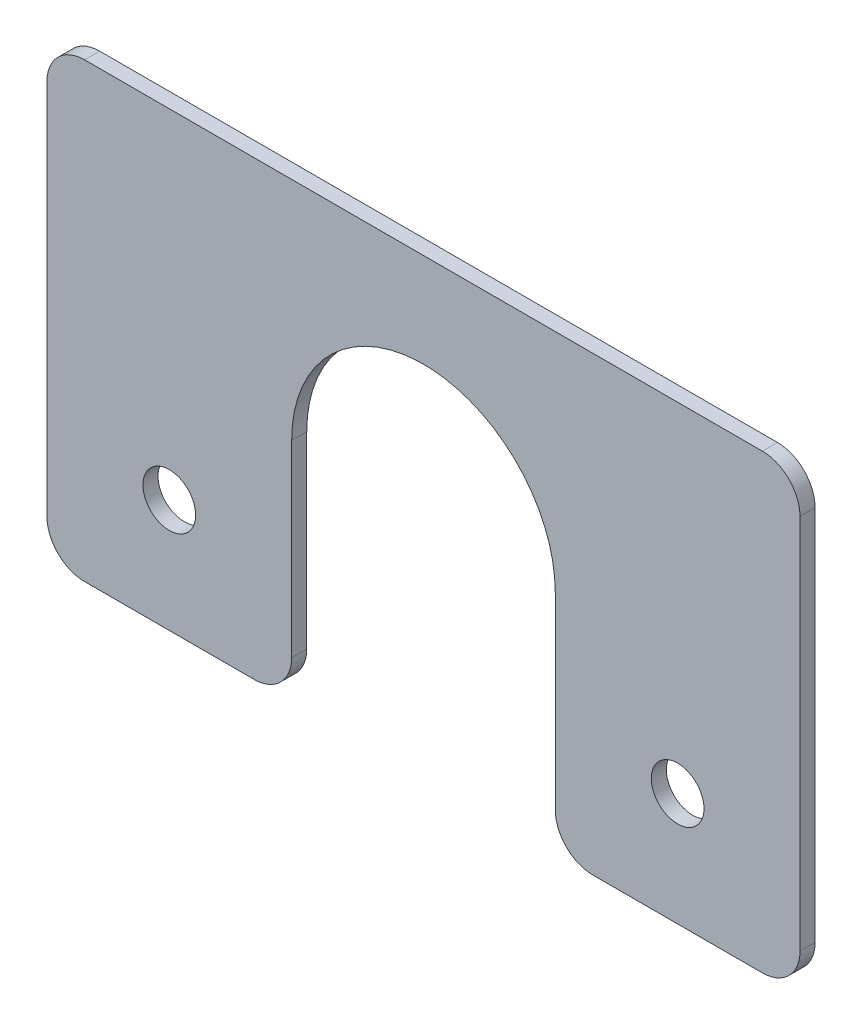
ISO-10303-21;
HEADER;
FILE_DESCRIPTION(('STEP AP214'),'2;1');
FILE_NAME('part.step','',(''),(''),'','','');
FILE_SCHEMA(('AUTOMOTIVE_DESIGN { 1 0 10303 214 1 1 1 1 }'));
ENDSEC;
DATA;
#1=APPLICATION_CONTEXT('core data for automotive mechanical design processes');
#2=APPLICATION_PROTOCOL_DEFINITION('international standard','automotive_design',2000,#1);
#3=PRODUCT_CONTEXT('',#1,'mechanical');
#4=PRODUCT('Part','Part','',(#3));
#5=PRODUCT_RELATED_PRODUCT_CATEGORY('part','',(#4));
#6=PRODUCT_DEFINITION_FORMATION('','',#4);
#7=PRODUCT_DEFINITION_CONTEXT('part definition',#1,'design');
#8=PRODUCT_DEFINITION('design','',#6,#7);
#9=PRODUCT_DEFINITION_SHAPE('','',#8);
#10=(LENGTH_UNIT() NAMED_UNIT(*) SI_UNIT(.MILLI.,.METRE.));
#11=(NAMED_UNIT(*) PLANE_ANGLE_UNIT() SI_UNIT($,.RADIAN.));
#12=(NAMED_UNIT(*) SI_UNIT($,.STERADIAN.) SOLID_ANGLE_UNIT());
#13=UNCERTAINTY_MEASURE_WITH_UNIT(LENGTH_MEASURE(1.E-05),#10,'distance_accuracy_value','');
#14=(GEOMETRIC_REPRESENTATION_CONTEXT(3) GLOBAL_UNCERTAINTY_ASSIGNED_CONTEXT((#13)) GLOBAL_UNIT_ASSIGNED_CONTEXT((#10,
#11,#12)) REPRESENTATION_CONTEXT('',''));
#15=CARTESIAN_POINT('',(0.,0.,0.));
#16=DIRECTION('',(0.,0.,1.));
#17=DIRECTION('',(1.,0.,0.));
#18=AXIS2_PLACEMENT_3D('',#15,#16,#17);
#19=CARTESIAN_POINT('',(-50.,-30.,-2.));
#20=DIRECTION('',(0.,-1.,0.));
#21=DIRECTION('',(0.,0.,-1.));
#22=AXIS2_PLACEMENT_3D('',#19,#20,#21);
#23=PLANE('',#22);
#24=DIRECTION('',(1.,0.,0.));
#25=VECTOR('',#24,1.);
#26=CARTESIAN_POINT('',(-50.,-30.,-2.));
#27=LINE('',#26,#25);
#28=CARTESIAN_POINT('',(22.5,-30.,-2.));
#29=VERTEX_POINT('',#28);
#30=CARTESIAN_POINT('',(45.,-30.,-2.));
#31=VERTEX_POINT('',#30);
#32=EDGE_CURVE('E186',#29,#31,#27,.T.);
#33=ORIENTED_EDGE('',*,*,#32,.T.);
#34=DIRECTION('',(0.,0.,1.));
#35=VECTOR('',#34,1.);
#36=CARTESIAN_POINT('',(45.,-30.,-2.));
#37=LINE('',#36,#35);
#38=CARTESIAN_POINT('',(45.,-30.,0.));
#39=VERTEX_POINT('',#38);
#40=EDGE_CURVE('E202',#31,#39,#37,.T.);
#41=ORIENTED_EDGE('',*,*,#40,.T.);
#42=DIRECTION('',(1.,0.,0.));
#43=VECTOR('',#42,1.);
#44=CARTESIAN_POINT('',(-50.,-30.,0.));
#45=LINE('',#44,#43);
#46=CARTESIAN_POINT('',(22.5,-30.,0.));
#47=VERTEX_POINT('',#46);
#48=EDGE_CURVE('E199',#47,#39,#45,.T.);
#49=ORIENTED_EDGE('',*,*,#48,.F.);
#50=DIRECTION('',(0.,0.,1.));
#51=VECTOR('',#50,1.);
#52=CARTESIAN_POINT('',(22.5,-30.,-2.));
#53=LINE('',#52,#51);
#54=EDGE_CURVE('E190',#47,#29,#53,.F.);
#55=ORIENTED_EDGE('',*,*,#54,.T.);
#56=EDGE_LOOP('',(#33,#41,#49,#55));
#57=FACE_BOUND('',#56,.T.);
#58=ADVANCED_FACE('F39',(#57),#23,.T.);
#59=CARTESIAN_POINT('',(50.,-30.,-2.));
#60=DIRECTION('',(1.,0.,0.));
#61=DIRECTION('',(0.,0.,-1.));
#62=AXIS2_PLACEMENT_3D('',#59,#60,#61);
#63=PLANE('',#62);
#64=DIRECTION('',(0.,1.,0.));
#65=VECTOR('',#64,1.);
#66=CARTESIAN_POINT('',(50.,-30.,0.));
#67=LINE('',#66,#65);
#68=CARTESIAN_POINT('',(50.,-25.,0.));
#69=VERTEX_POINT('',#68);
#70=CARTESIAN_POINT('',(50.,25.,0.));
#71=VERTEX_POINT('',#70);
#72=EDGE_CURVE('E175',#69,#71,#67,.T.);
#73=ORIENTED_EDGE('',*,*,#72,.F.);
#74=DIRECTION('',(0.,0.,1.));
#75=VECTOR('',#74,1.);
#76=CARTESIAN_POINT('',(50.,-25.,-2.));
#77=LINE('',#76,#75);
#78=CARTESIAN_POINT('',(50.,-25.,-2.));
#79=VERTEX_POINT('',#78);
#80=EDGE_CURVE('E218',#69,#79,#77,.F.);
#81=ORIENTED_EDGE('',*,*,#80,.T.);
#82=DIRECTION('',(0.,1.,0.));
#83=VECTOR('',#82,1.);
#84=CARTESIAN_POINT('',(50.,-30.,-2.));
#85=LINE('',#84,#83);
#86=CARTESIAN_POINT('',(50.,25.,-2.));
#87=VERTEX_POINT('',#86);
#88=EDGE_CURVE('E176',#79,#87,#85,.T.);
#89=ORIENTED_EDGE('',*,*,#88,.T.);
#90=DIRECTION('',(0.,0.,1.));
#91=VECTOR('',#90,1.);
#92=CARTESIAN_POINT('',(50.,25.,-2.));
#93=LINE('',#92,#91);
#94=EDGE_CURVE('E215',#87,#71,#93,.T.);
#95=ORIENTED_EDGE('',*,*,#94,.T.);
#96=EDGE_LOOP('',(#73,#81,#89,#95));
#97=FACE_BOUND('',#96,.T.);
#98=ADVANCED_FACE('F280',(#97),#63,.T.);
#99=CARTESIAN_POINT('',(-45.,-30.,-2.));
#100=VERTEX_POINT('',#99);
#101=CARTESIAN_POINT('',(-22.5,-30.,-2.));
#102=VERTEX_POINT('',#101);
#103=EDGE_CURVE('E187',#100,#102,#27,.T.);
#104=ORIENTED_EDGE('',*,*,#103,.T.);
#105=DIRECTION('',(0.,0.,1.));
#106=VECTOR('',#105,1.);
#107=CARTESIAN_POINT('',(-22.5,-30.,0.));
#108=LINE('',#107,#106);
#109=CARTESIAN_POINT('',(-22.5,-30.,0.));
#110=VERTEX_POINT('',#109);
#111=EDGE_CURVE('E243',#102,#110,#108,.T.);
#112=ORIENTED_EDGE('',*,*,#111,.T.);
#113=CARTESIAN_POINT('',(-45.,-30.,0.));
#114=VERTEX_POINT('',#113);
#115=EDGE_CURVE('E180',#114,#110,#45,.T.);
#116=ORIENTED_EDGE('',*,*,#115,.F.);
#117=DIRECTION('',(0.,0.,1.));
#118=VECTOR('',#117,1.);
#119=CARTESIAN_POINT('',(-45.,-30.,-2.));
#120=LINE('',#119,#118);
#121=EDGE_CURVE('E241',#114,#100,#120,.F.);
#122=ORIENTED_EDGE('',*,*,#121,.T.);
#123=EDGE_LOOP('',(#104,#112,#116,#122));
#124=FACE_BOUND('',#123,.T.);
#125=ADVANCED_FACE('F249',(#124),#23,.T.);
#126=CARTESIAN_POINT('',(-50.,-30.,-2.));
#127=DIRECTION('',(-1.,0.,0.));
#128=DIRECTION('',(0.,0.,1.));
#129=AXIS2_PLACEMENT_3D('',#126,#127,#128);
#130=PLANE('',#129);
#131=DIRECTION('',(0.,-1.,0.));
#132=VECTOR('',#131,1.);
#133=CARTESIAN_POINT('',(-50.,-30.,-2.));
#134=LINE('',#133,#132);
#135=CARTESIAN_POINT('',(-50.,25.,-2.));
#136=VERTEX_POINT('',#135);
#137=CARTESIAN_POINT('',(-50.,-25.,-2.));
#138=VERTEX_POINT('',#137);
#139=EDGE_CURVE('E183',#136,#138,#134,.T.);
#140=ORIENTED_EDGE('',*,*,#139,.T.);
#141=DIRECTION('',(0.,0.,1.));
#142=VECTOR('',#141,1.);
#143=CARTESIAN_POINT('',(-50.,-25.,-2.));
#144=LINE('',#143,#142);
#145=CARTESIAN_POINT('',(-50.,-25.,0.));
#146=VERTEX_POINT('',#145);
#147=EDGE_CURVE('E238',#138,#146,#144,.T.);
#148=ORIENTED_EDGE('',*,*,#147,.T.);
#149=DIRECTION('',(0.,-1.,0.));
#150=VECTOR('',#149,1.);
#151=CARTESIAN_POINT('',(-50.,-30.,0.));
#152=LINE('',#151,#150);
#153=CARTESIAN_POINT('',(-50.,25.,0.));
#154=VERTEX_POINT('',#153);
#155=EDGE_CURVE('E196',#154,#146,#152,.T.);
#156=ORIENTED_EDGE('',*,*,#155,.F.);
#157=DIRECTION('',(0.,0.,1.));
#158=VECTOR('',#157,1.);
#159=CARTESIAN_POINT('',(-50.,25.,-2.));
#160=LINE('',#159,#158);
#161=EDGE_CURVE('E236',#154,#136,#160,.F.);
#162=ORIENTED_EDGE('',*,*,#161,.T.);
#163=EDGE_LOOP('',(#140,#148,#156,#162));
#164=FACE_BOUND('',#163,.T.);
#165=ADVANCED_FACE('F260',(#164),#130,.T.);
#166=CARTESIAN_POINT('',(-50.,30.,-2.));
#167=DIRECTION('',(0.,1.,0.));
#168=DIRECTION('',(0.,0.,1.));
#169=AXIS2_PLACEMENT_3D('',#166,#167,#168);
#170=PLANE('',#169);
#171=DIRECTION('',(-1.,0.,0.));
#172=VECTOR('',#171,1.);
#173=CARTESIAN_POINT('',(-50.,30.,0.));
#174=LINE('',#173,#172);
#175=CARTESIAN_POINT('',(45.,30.,0.));
#176=VERTEX_POINT('',#175);
#177=CARTESIAN_POINT('',(-45.,30.,0.));
#178=VERTEX_POINT('',#177);
#179=EDGE_CURVE('E193',#176,#178,#174,.T.);
#180=ORIENTED_EDGE('',*,*,#179,.F.);
#181=DIRECTION('',(0.,0.,1.));
#182=VECTOR('',#181,1.);
#183=CARTESIAN_POINT('',(45.,30.,-2.));
#184=LINE('',#183,#182);
#185=CARTESIAN_POINT('',(45.,30.,-2.));
#186=VERTEX_POINT('',#185);
#187=EDGE_CURVE('E233',#176,#186,#184,.F.);
#188=ORIENTED_EDGE('',*,*,#187,.T.);
#189=DIRECTION('',(-1.,0.,0.));
#190=VECTOR('',#189,1.);
#191=CARTESIAN_POINT('',(-50.,30.,-2.));
#192=LINE('',#191,#190);
#193=CARTESIAN_POINT('',(-45.,30.,-2.));
#194=VERTEX_POINT('',#193);
#195=EDGE_CURVE('E179',#186,#194,#192,.T.);
#196=ORIENTED_EDGE('',*,*,#195,.T.);
#197=DIRECTION('',(0.,0.,1.));
#198=VECTOR('',#197,1.);
#199=CARTESIAN_POINT('',(-45.,30.,-2.));
#200=LINE('',#199,#198);
#201=EDGE_CURVE('E230',#194,#178,#200,.T.);
#202=ORIENTED_EDGE('',*,*,#201,.T.);
#203=EDGE_LOOP('',(#180,#188,#196,#202));
#204=FACE_BOUND('',#203,.T.);
#205=ADVANCED_FACE('F272',(#204),#170,.T.);
#206=CARTESIAN_POINT('',(0.,0.,-2.));
#207=DIRECTION('',(0.,0.,-1.));
#208=DIRECTION('',(-1.,0.,0.));
#209=AXIS2_PLACEMENT_3D('',#206,#207,#208);
#210=PLANE('',#209);
#211=CARTESIAN_POINT('',(-33.75,-15.,-2.));
#212=DIRECTION('',(0.,0.,-1.));
#213=DIRECTION('',(-1.,0.,0.));
#214=AXIS2_PLACEMENT_3D('',#211,#212,#213);
#215=CIRCLE('',#214,3.5);
#216=CARTESIAN_POINT('',(-37.25,-15.,-2.));
#217=VERTEX_POINT('',#216);
#218=EDGE_CURVE('E162',#217,#217,#215,.T.);
#219=ORIENTED_EDGE('',*,*,#218,.F.);
#220=EDGE_LOOP('',(#219));
#221=FACE_BOUND('',#220,.T.);
#222=CARTESIAN_POINT('',(33.75,-15.,-2.));
#223=DIRECTION('',(0.,0.,-1.));
#224=DIRECTION('',(-1.,0.,0.));
#225=AXIS2_PLACEMENT_3D('',#222,#223,#224);
#226=CIRCLE('',#225,3.5);
#227=CARTESIAN_POINT('',(30.25,-15.,-2.));
#228=VERTEX_POINT('',#227);
#229=EDGE_CURVE('E166',#228,#228,#226,.T.);
#230=ORIENTED_EDGE('',*,*,#229,.F.);
#231=EDGE_LOOP('',(#230));
#232=FACE_BOUND('',#231,.T.);
#233=DIRECTION('',(0.,1.,0.));
#234=VECTOR('',#233,1.);
#235=CARTESIAN_POINT('',(-17.5,0.,-2.));
#236=LINE('',#235,#234);
#237=CARTESIAN_POINT('',(-17.5,-25.,-2.));
#238=VERTEX_POINT('',#237);
#239=CARTESIAN_POINT('',(-17.5,0.,-2.));
#240=VERTEX_POINT('',#239);
#241=EDGE_CURVE('E159',#238,#240,#236,.T.);
#242=ORIENTED_EDGE('',*,*,#241,.F.);
#243=CARTESIAN_POINT('',(-22.5,-25.,-2.));
#244=DIRECTION('',(0.,0.,-1.));
#245=DIRECTION('',(-1.,0.,0.));
#246=AXIS2_PLACEMENT_3D('',#243,#244,#245);
#247=CIRCLE('',#246,5.);
#248=EDGE_CURVE('E11',#238,#102,#247,.T.);
#249=ORIENTED_EDGE('',*,*,#248,.T.);
#250=ORIENTED_EDGE('',*,*,#103,.F.);
#251=CARTESIAN_POINT('',(-45.,-25.,-2.));
#252=DIRECTION('',(0.,0.,-1.));
#253=DIRECTION('',(-1.,0.,0.));
#254=AXIS2_PLACEMENT_3D('',#251,#252,#253);
#255=CIRCLE('',#254,5.);
#256=EDGE_CURVE('E222',#100,#138,#255,.T.);
#257=ORIENTED_EDGE('',*,*,#256,.T.);
#258=ORIENTED_EDGE('',*,*,#139,.F.);
#259=CARTESIAN_POINT('',(-45.,25.,-2.));
#260=DIRECTION('',(0.,0.,-1.));
#261=DIRECTION('',(-1.,0.,0.));
#262=AXIS2_PLACEMENT_3D('',#259,#260,#261);
#263=CIRCLE('',#262,5.);
#264=EDGE_CURVE('E220',#136,#194,#263,.T.);
#265=ORIENTED_EDGE('',*,*,#264,.T.);
#266=ORIENTED_EDGE('',*,*,#195,.F.);
#267=CARTESIAN_POINT('',(45.,25.,-2.));
#268=DIRECTION('',(0.,0.,-1.));
#269=DIRECTION('',(-1.,0.,0.));
#270=AXIS2_PLACEMENT_3D('',#267,#268,#269);
#271=CIRCLE('',#270,5.);
#272=EDGE_CURVE('E226',#186,#87,#271,.T.);
#273=ORIENTED_EDGE('',*,*,#272,.T.);
#274=ORIENTED_EDGE('',*,*,#88,.F.);
#275=CARTESIAN_POINT('',(45.,-25.,-2.));
#276=DIRECTION('',(0.,0.,-1.));
#277=DIRECTION('',(-1.,0.,0.));
#278=AXIS2_PLACEMENT_3D('',#275,#276,#277);
#279=CIRCLE('',#278,5.);
#280=EDGE_CURVE('E228',#79,#31,#279,.T.);
#281=ORIENTED_EDGE('',*,*,#280,.T.);
#282=ORIENTED_EDGE('',*,*,#32,.F.);
#283=CARTESIAN_POINT('',(22.5,-25.,-2.));
#284=DIRECTION('',(0.,0.,-1.));
#285=DIRECTION('',(-1.,0.,0.));
#286=AXIS2_PLACEMENT_3D('',#283,#284,#285);
#287=CIRCLE('',#286,5.);
#288=CARTESIAN_POINT('',(17.5,-25.,-2.));
#289=VERTEX_POINT('',#288);
#290=EDGE_CURVE('E224',#29,#289,#287,.T.);
#291=ORIENTED_EDGE('',*,*,#290,.T.);
#292=DIRECTION('',(0.,-1.,0.));
#293=VECTOR('',#292,1.);
#294=CARTESIAN_POINT('',(17.5,0.,-2.));
#295=LINE('',#294,#293);
#296=CARTESIAN_POINT('',(17.5,0.,-2.));
#297=VERTEX_POINT('',#296);
#298=EDGE_CURVE('E172',#297,#289,#295,.T.);
#299=ORIENTED_EDGE('',*,*,#298,.F.);
#300=CARTESIAN_POINT('',(0.,0.,-2.));
#301=DIRECTION('',(0.,0.,-1.));
#302=DIRECTION('',(-1.,0.,0.));
#303=AXIS2_PLACEMENT_3D('',#300,#301,#302);
#304=CIRCLE('',#303,17.5);
#305=EDGE_CURVE('E158',#240,#297,#304,.T.);
#306=ORIENTED_EDGE('',*,*,#305,.F.);
#307=EDGE_LOOP('',(#242,#249,#250,#257,#258,#265,#266,#273,#274,#281,#282,#291,#299,#306));
#308=FACE_BOUND('',#307,.T.);
#309=ADVANCED_FACE('F265',(#221,#232,#308),#210,.T.);
#310=CARTESIAN_POINT('',(0.,0.,0.));
#311=DIRECTION('',(0.,0.,-1.));
#312=DIRECTION('',(-1.,0.,0.));
#313=AXIS2_PLACEMENT_3D('',#310,#311,#312);
#314=PLANE('',#313);
#315=CARTESIAN_POINT('',(-33.75,-15.,0.));
#316=DIRECTION('',(0.,0.,1.));
#317=DIRECTION('',(1.,0.,0.));
#318=AXIS2_PLACEMENT_3D('',#315,#316,#317);
#319=CIRCLE('',#318,3.5);
#320=CARTESIAN_POINT('',(-30.25,-15.,0.));
#321=VERTEX_POINT('',#320);
#322=EDGE_CURVE('E355',#321,#321,#319,.T.);
#323=ORIENTED_EDGE('',*,*,#322,.F.);
#324=EDGE_LOOP('',(#323));
#325=FACE_BOUND('',#324,.T.);
#326=CARTESIAN_POINT('',(33.75,-15.,0.));
#327=DIRECTION('',(0.,0.,1.));
#328=DIRECTION('',(1.,0.,0.));
#329=AXIS2_PLACEMENT_3D('',#326,#327,#328);
#330=CIRCLE('',#329,3.5);
#331=CARTESIAN_POINT('',(37.25,-15.,0.));
#332=VERTEX_POINT('',#331);
#333=EDGE_CURVE('E358',#332,#332,#330,.T.);
#334=ORIENTED_EDGE('',*,*,#333,.F.);
#335=EDGE_LOOP('',(#334));
#336=FACE_BOUND('',#335,.T.);
#337=ORIENTED_EDGE('',*,*,#115,.T.);
#338=CARTESIAN_POINT('',(-22.5,-25.,0.));
#339=DIRECTION('',(0.,0.,-1.));
#340=DIRECTION('',(-1.,0.,0.));
#341=AXIS2_PLACEMENT_3D('',#338,#339,#340);
#342=CIRCLE('',#341,5.);
#343=CARTESIAN_POINT('',(-17.5,-25.,0.));
#344=VERTEX_POINT('',#343);
#345=EDGE_CURVE('E61',#110,#344,#342,.F.);
#346=ORIENTED_EDGE('',*,*,#345,.T.);
#347=DIRECTION('',(0.,-1.,0.));
#348=VECTOR('',#347,1.);
#349=CARTESIAN_POINT('',(-17.5,0.,0.));
#350=LINE('',#349,#348);
#351=CARTESIAN_POINT('',(-17.5,0.,0.));
#352=VERTEX_POINT('',#351);
#353=EDGE_CURVE('E150',#352,#344,#350,.T.);
#354=ORIENTED_EDGE('',*,*,#353,.F.);
#355=CARTESIAN_POINT('',(0.,0.,0.));
#356=DIRECTION('',(0.,0.,1.));
#357=DIRECTION('',(1.,0.,0.));
#358=AXIS2_PLACEMENT_3D('',#355,#356,#357);
#359=CIRCLE('',#358,17.5);
#360=CARTESIAN_POINT('',(17.5,0.,0.));
#361=VERTEX_POINT('',#360);
#362=EDGE_CURVE('E155',#361,#352,#359,.T.);
#363=ORIENTED_EDGE('',*,*,#362,.F.);
#364=DIRECTION('',(0.,1.,0.));
#365=VECTOR('',#364,1.);
#366=CARTESIAN_POINT('',(17.5,-30.,0.));
#367=LINE('',#366,#365);
#368=CARTESIAN_POINT('',(17.5,-25.,0.));
#369=VERTEX_POINT('',#368);
#370=EDGE_CURVE('E140',#369,#361,#367,.T.);
#371=ORIENTED_EDGE('',*,*,#370,.F.);
#372=CARTESIAN_POINT('',(22.5,-25.,0.));
#373=DIRECTION('',(0.,0.,-1.));
#374=DIRECTION('',(-1.,0.,0.));
#375=AXIS2_PLACEMENT_3D('',#372,#373,#374);
#376=CIRCLE('',#375,5.);
#377=EDGE_CURVE('E209',#369,#47,#376,.F.);
#378=ORIENTED_EDGE('',*,*,#377,.T.);
#379=ORIENTED_EDGE('',*,*,#48,.T.);
#380=CARTESIAN_POINT('',(45.,-25.,0.));
#381=DIRECTION('',(0.,0.,-1.));
#382=DIRECTION('',(-1.,0.,0.));
#383=AXIS2_PLACEMENT_3D('',#380,#381,#382);
#384=CIRCLE('',#383,5.);
#385=EDGE_CURVE('E213',#39,#69,#384,.F.);
#386=ORIENTED_EDGE('',*,*,#385,.T.);
#387=ORIENTED_EDGE('',*,*,#72,.T.);
#388=CARTESIAN_POINT('',(45.,25.,0.));
#389=DIRECTION('',(0.,0.,-1.));
#390=DIRECTION('',(-1.,0.,0.));
#391=AXIS2_PLACEMENT_3D('',#388,#389,#390);
#392=CIRCLE('',#391,5.);
#393=EDGE_CURVE('E211',#71,#176,#392,.F.);
#394=ORIENTED_EDGE('',*,*,#393,.T.);
#395=ORIENTED_EDGE('',*,*,#179,.T.);
#396=CARTESIAN_POINT('',(-45.,25.,0.));
#397=DIRECTION('',(0.,0.,-1.));
#398=DIRECTION('',(-1.,0.,0.));
#399=AXIS2_PLACEMENT_3D('',#396,#397,#398);
#400=CIRCLE('',#399,5.);
#401=EDGE_CURVE('E205',#178,#154,#400,.F.);
#402=ORIENTED_EDGE('',*,*,#401,.T.);
#403=ORIENTED_EDGE('',*,*,#155,.T.);
#404=CARTESIAN_POINT('',(-45.,-25.,0.));
#405=DIRECTION('',(0.,0.,-1.));
#406=DIRECTION('',(-1.,0.,0.));
#407=AXIS2_PLACEMENT_3D('',#404,#405,#406);
#408=CIRCLE('',#407,5.);
#409=EDGE_CURVE('E207',#146,#114,#408,.F.);
#410=ORIENTED_EDGE('',*,*,#409,.T.);
#411=EDGE_LOOP('',(#337,#346,#354,#363,#371,#378,#379,#386,#387,#394,#395,#402,#403,#410));
#412=FACE_BOUND('',#411,.T.);
#413=ADVANCED_FACE('F161',(#325,#336,#412),#314,.F.);
#414=CARTESIAN_POINT('',(0.,0.,-10.));
#415=DIRECTION('',(0.,0.,1.));
#416=DIRECTION('',(1.,0.,0.));
#417=AXIS2_PLACEMENT_3D('',#414,#415,#416);
#418=CYLINDRICAL_SURFACE('',#417,17.5);
#419=ORIENTED_EDGE('',*,*,#305,.T.);
#420=DIRECTION('',(0.,0.,1.));
#421=VECTOR('',#420,1.);
#422=CARTESIAN_POINT('',(17.5,0.,-10.));
#423=LINE('',#422,#421);
#424=EDGE_CURVE('E144',#297,#361,#423,.T.);
#425=ORIENTED_EDGE('',*,*,#424,.T.);
#426=ORIENTED_EDGE('',*,*,#362,.T.);
#427=DIRECTION('',(0.,0.,1.));
#428=VECTOR('',#427,1.);
#429=CARTESIAN_POINT('',(-17.5,0.,-10.));
#430=LINE('',#429,#428);
#431=EDGE_CURVE('E149',#240,#352,#430,.T.);
#432=ORIENTED_EDGE('',*,*,#431,.F.);
#433=EDGE_LOOP('',(#419,#425,#426,#432));
#434=FACE_BOUND('',#433,.T.);
#435=ADVANCED_FACE('F153',(#434),#418,.F.);
#436=CARTESIAN_POINT('',(17.5,-30.,-10.));
#437=DIRECTION('',(1.,0.,0.));
#438=DIRECTION('',(0.,1.,0.));
#439=AXIS2_PLACEMENT_3D('',#436,#437,#438);
#440=PLANE('',#439);
#441=ORIENTED_EDGE('',*,*,#298,.T.);
#442=DIRECTION('',(0.,0.,1.));
#443=VECTOR('',#442,1.);
#444=CARTESIAN_POINT('',(17.5,-25.,0.));
#445=LINE('',#444,#443);
#446=EDGE_CURVE('E147',#289,#369,#445,.T.);
#447=ORIENTED_EDGE('',*,*,#446,.T.);
#448=ORIENTED_EDGE('',*,*,#370,.T.);
#449=ORIENTED_EDGE('',*,*,#424,.F.);
#450=EDGE_LOOP('',(#441,#447,#448,#449));
#451=FACE_BOUND('',#450,.T.);
#452=ADVANCED_FACE('F143',(#451),#440,.F.);
#453=CARTESIAN_POINT('',(-17.5,0.,-10.));
#454=DIRECTION('',(-1.,0.,0.));
#455=DIRECTION('',(0.,-1.,0.));
#456=AXIS2_PLACEMENT_3D('',#453,#454,#455);
#457=PLANE('',#456);
#458=ORIENTED_EDGE('',*,*,#353,.T.);
#459=DIRECTION('',(0.,0.,1.));
#460=VECTOR('',#459,1.);
#461=CARTESIAN_POINT('',(-17.5,-25.,-2.));
#462=LINE('',#461,#460);
#463=EDGE_CURVE('E47',#344,#238,#462,.F.);
#464=ORIENTED_EDGE('',*,*,#463,.T.);
#465=ORIENTED_EDGE('',*,*,#241,.T.);
#466=ORIENTED_EDGE('',*,*,#431,.T.);
#467=EDGE_LOOP('',(#458,#464,#465,#466));
#468=FACE_BOUND('',#467,.T.);
#469=ADVANCED_FACE('F323',(#468),#457,.F.);
#470=CARTESIAN_POINT('',(45.,-25.,-2.));
#471=DIRECTION('',(0.,0.,1.));
#472=DIRECTION('',(1.,0.,0.));
#473=AXIS2_PLACEMENT_3D('',#470,#471,#472);
#474=CYLINDRICAL_SURFACE('',#473,5.);
#475=ORIENTED_EDGE('',*,*,#280,.F.);
#476=ORIENTED_EDGE('',*,*,#80,.F.);
#477=ORIENTED_EDGE('',*,*,#385,.F.);
#478=ORIENTED_EDGE('',*,*,#40,.F.);
#479=EDGE_LOOP('',(#475,#476,#477,#478));
#480=FACE_BOUND('',#479,.T.);
#481=ADVANCED_FACE('F288',(#480),#474,.T.);
#482=CARTESIAN_POINT('',(45.,25.,-2.));
#483=DIRECTION('',(0.,0.,1.));
#484=DIRECTION('',(1.,0.,0.));
#485=AXIS2_PLACEMENT_3D('',#482,#483,#484);
#486=CYLINDRICAL_SURFACE('',#485,5.);
#487=ORIENTED_EDGE('',*,*,#272,.F.);
#488=ORIENTED_EDGE('',*,*,#187,.F.);
#489=ORIENTED_EDGE('',*,*,#393,.F.);
#490=ORIENTED_EDGE('',*,*,#94,.F.);
#491=EDGE_LOOP('',(#487,#488,#489,#490));
#492=FACE_BOUND('',#491,.T.);
#493=ADVANCED_FACE('F278',(#492),#486,.T.);
#494=CARTESIAN_POINT('',(22.5,-25.,-10.));
#495=DIRECTION('',(0.,0.,-1.));
#496=DIRECTION('',(-1.,0.,0.));
#497=AXIS2_PLACEMENT_3D('',#494,#495,#496);
#498=CYLINDRICAL_SURFACE('',#497,5.);
#499=ORIENTED_EDGE('',*,*,#290,.F.);
#500=ORIENTED_EDGE('',*,*,#54,.F.);
#501=ORIENTED_EDGE('',*,*,#377,.F.);
#502=ORIENTED_EDGE('',*,*,#446,.F.);
#503=EDGE_LOOP('',(#499,#500,#501,#502));
#504=FACE_BOUND('',#503,.T.);
#505=ADVANCED_FACE('F295',(#504),#498,.T.);
#506=CARTESIAN_POINT('',(-45.,-25.,-2.));
#507=DIRECTION('',(0.,0.,1.));
#508=DIRECTION('',(1.,0.,0.));
#509=AXIS2_PLACEMENT_3D('',#506,#507,#508);
#510=CYLINDRICAL_SURFACE('',#509,5.);
#511=ORIENTED_EDGE('',*,*,#256,.F.);
#512=ORIENTED_EDGE('',*,*,#121,.F.);
#513=ORIENTED_EDGE('',*,*,#409,.F.);
#514=ORIENTED_EDGE('',*,*,#147,.F.);
#515=EDGE_LOOP('',(#511,#512,#513,#514));
#516=FACE_BOUND('',#515,.T.);
#517=ADVANCED_FACE('F258',(#516),#510,.T.);
#518=CARTESIAN_POINT('',(-45.,25.,-2.));
#519=DIRECTION('',(0.,0.,1.));
#520=DIRECTION('',(1.,0.,0.));
#521=AXIS2_PLACEMENT_3D('',#518,#519,#520);
#522=CYLINDRICAL_SURFACE('',#521,5.);
#523=ORIENTED_EDGE('',*,*,#264,.F.);
#524=ORIENTED_EDGE('',*,*,#161,.F.);
#525=ORIENTED_EDGE('',*,*,#401,.F.);
#526=ORIENTED_EDGE('',*,*,#201,.F.);
#527=EDGE_LOOP('',(#523,#524,#525,#526));
#528=FACE_BOUND('',#527,.T.);
#529=ADVANCED_FACE('F269',(#528),#522,.T.);
#530=CARTESIAN_POINT('',(33.75,-15.,-10.));
#531=DIRECTION('',(0.,0.,1.));
#532=DIRECTION('',(1.,0.,0.));
#533=AXIS2_PLACEMENT_3D('',#530,#531,#532);
#534=CYLINDRICAL_SURFACE('',#533,3.5);
#535=ORIENTED_EDGE('',*,*,#229,.T.);
#536=EDGE_LOOP('',(#535));
#537=FACE_BOUND('',#536,.T.);
#538=ORIENTED_EDGE('',*,*,#333,.T.);
#539=EDGE_LOOP('',(#538));
#540=FACE_BOUND('',#539,.T.);
#541=ADVANCED_FACE('F301',(#537,#540),#534,.F.);
#542=CARTESIAN_POINT('',(-33.75,-15.,-10.));
#543=DIRECTION('',(0.,0.,1.));
#544=DIRECTION('',(1.,0.,0.));
#545=AXIS2_PLACEMENT_3D('',#542,#543,#544);
#546=CYLINDRICAL_SURFACE('',#545,3.5);
#547=ORIENTED_EDGE('',*,*,#218,.T.);
#548=EDGE_LOOP('',(#547));
#549=FACE_BOUND('',#548,.T.);
#550=ORIENTED_EDGE('',*,*,#322,.T.);
#551=EDGE_LOOP('',(#550));
#552=FACE_BOUND('',#551,.T.);
#553=ADVANCED_FACE('F297',(#549,#552),#546,.F.);
#554=CARTESIAN_POINT('',(-22.5,-25.,-2.));
#555=DIRECTION('',(0.,0.,-1.));
#556=DIRECTION('',(-1.,0.,0.));
#557=AXIS2_PLACEMENT_3D('',#554,#555,#556);
#558=CYLINDRICAL_SURFACE('',#557,5.);
#559=ORIENTED_EDGE('',*,*,#248,.F.);
#560=ORIENTED_EDGE('',*,*,#463,.F.);
#561=ORIENTED_EDGE('',*,*,#345,.F.);
#562=ORIENTED_EDGE('',*,*,#111,.F.);
#563=EDGE_LOOP('',(#559,#560,#561,#562));
#564=FACE_BOUND('',#563,.T.);
#565=ADVANCED_FACE('F41',(#564),#558,.T.);
#566=CLOSED_SHELL('',(#58,#98,#125,#165,#205,#309,#413,#435,#452,#469,#481,#493,#505,#517,#529,
#541,#553,#565));
#567=MANIFOLD_SOLID_BREP('B2',#566);
#568=ADVANCED_BREP_SHAPE_REPRESENTATION('',(#18,#567),#14);
#569=SHAPE_DEFINITION_REPRESENTATION(#9,#568);
ENDSEC;
END-ISO-10303-21;
